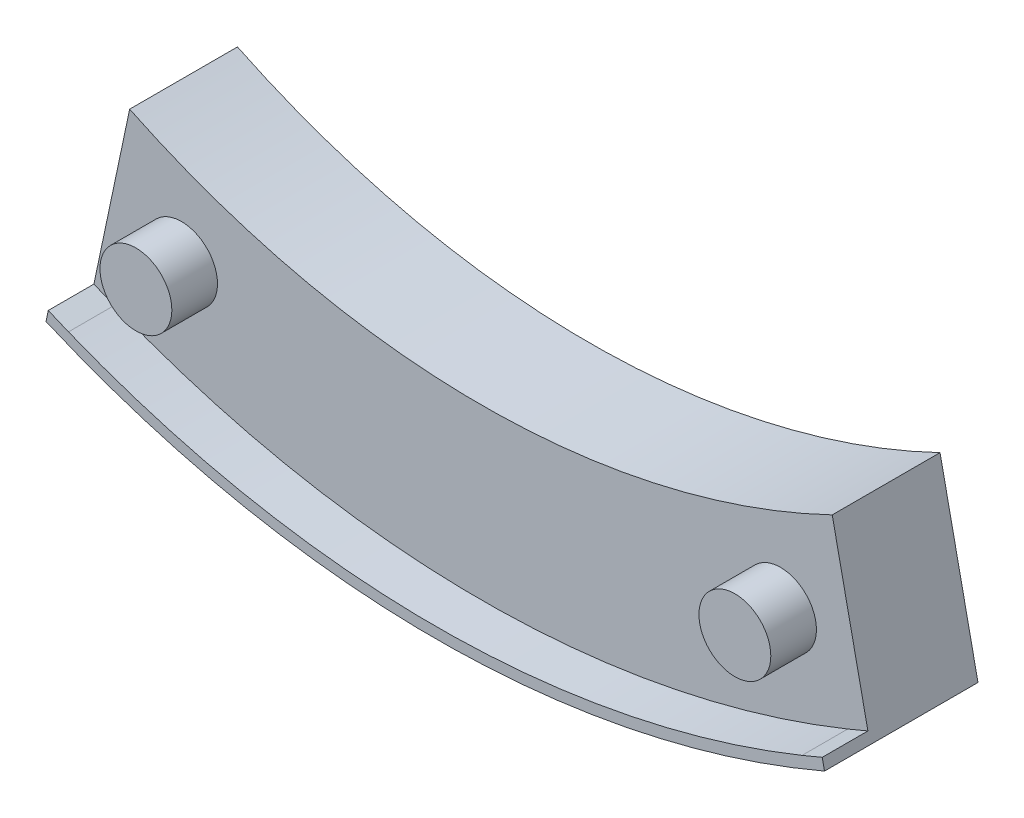
ISO-10303-21;
HEADER;
FILE_DESCRIPTION(('STEP AP214'),'2;1');
FILE_NAME('part.step','',(''),(''),'','','');
FILE_SCHEMA(('AUTOMOTIVE_DESIGN { 1 0 10303 214 1 1 1 1 }'));
ENDSEC;
DATA;
#1=APPLICATION_CONTEXT('core data for automotive mechanical design processes');
#2=APPLICATION_PROTOCOL_DEFINITION('international standard','automotive_design',2000,#1);
#3=PRODUCT_CONTEXT('',#1,'mechanical');
#4=PRODUCT('Part','Part','',(#3));
#5=PRODUCT_RELATED_PRODUCT_CATEGORY('part','',(#4));
#6=PRODUCT_DEFINITION_FORMATION('','',#4);
#7=PRODUCT_DEFINITION_CONTEXT('part definition',#1,'design');
#8=PRODUCT_DEFINITION('design','',#6,#7);
#9=PRODUCT_DEFINITION_SHAPE('','',#8);
#10=(LENGTH_UNIT() NAMED_UNIT(*) SI_UNIT(.MILLI.,.METRE.));
#11=(NAMED_UNIT(*) PLANE_ANGLE_UNIT() SI_UNIT($,.RADIAN.));
#12=(NAMED_UNIT(*) SI_UNIT($,.STERADIAN.) SOLID_ANGLE_UNIT());
#13=UNCERTAINTY_MEASURE_WITH_UNIT(LENGTH_MEASURE(1.E-05),#10,'distance_accuracy_value','');
#14=(GEOMETRIC_REPRESENTATION_CONTEXT(3) GLOBAL_UNCERTAINTY_ASSIGNED_CONTEXT((#13)) GLOBAL_UNIT_ASSIGNED_CONTEXT((#10,
#11,#12)) REPRESENTATION_CONTEXT('',''));
#15=CARTESIAN_POINT('',(0.,0.,0.));
#16=DIRECTION('',(0.,0.,1.));
#17=DIRECTION('',(1.,0.,0.));
#18=AXIS2_PLACEMENT_3D('',#15,#16,#17);
#19=CARTESIAN_POINT('',(10.5320699095967,2.21997126669057,6.));
#20=DIRECTION('',(0.97849931061418,0.206250088794103,0.));
#21=DIRECTION('',(-0.206250088794103,0.97849931061418,0.));
#22=AXIS2_PLACEMENT_3D('',#19,#20,#21);
#23=PLANE('',#22);
#24=DIRECTION('',(0.206250088794103,-0.97849931061418,0.));
#25=VECTOR('',#24,1.);
#26=CARTESIAN_POINT('',(10.5320699095967,2.21997126669057,0.));
#27=LINE('',#26,#25);
#28=CARTESIAN_POINT('',(19.5439178504137,-40.534371526598,0.));
#29=VERTEX_POINT('',#28);
#30=CARTESIAN_POINT('',(21.6564801158046,-50.5568676738755,0.));
#31=VERTEX_POINT('',#30);
#32=EDGE_CURVE('E149',#29,#31,#27,.T.);
#33=ORIENTED_EDGE('',*,*,#32,.F.);
#34=DIRECTION('',(0.,0.,-1.));
#35=VECTOR('',#34,1.);
#36=CARTESIAN_POINT('',(19.5439178504137,-40.534371526598,6.));
#37=LINE('',#36,#35);
#38=CARTESIAN_POINT('',(19.5439178504137,-40.534371526598,6.));
#39=VERTEX_POINT('',#38);
#40=EDGE_CURVE('E11',#39,#29,#37,.T.);
#41=ORIENTED_EDGE('',*,*,#40,.F.);
#42=DIRECTION('',(0.206250088794103,-0.97849931061418,0.));
#43=VECTOR('',#42,1.);
#44=CARTESIAN_POINT('',(10.5320699095967,2.21997126669057,6.));
#45=LINE('',#44,#43);
#46=CARTESIAN_POINT('',(21.5296214587928,-49.9550201345254,6.));
#47=VERTEX_POINT('',#46);
#48=EDGE_CURVE('E154',#39,#47,#45,.T.);
#49=ORIENTED_EDGE('',*,*,#48,.T.);
#50=DIRECTION('',(0.,0.,-1.));
#51=VECTOR('',#50,1.);
#52=CARTESIAN_POINT('',(21.5296214587928,-49.9550201345254,8.54));
#53=LINE('',#52,#51);
#54=CARTESIAN_POINT('',(21.5296214587928,-49.9550201345254,8.54));
#55=VERTEX_POINT('',#54);
#56=EDGE_CURVE('E135',#55,#47,#53,.T.);
#57=ORIENTED_EDGE('',*,*,#56,.F.);
#58=DIRECTION('',(0.206250088794103,-0.97849931061418,0.));
#59=VECTOR('',#58,1.);
#60=CARTESIAN_POINT('',(10.5320699095967,2.21997126669057,8.54));
#61=LINE('',#60,#59);
#62=CARTESIAN_POINT('',(21.6564801158046,-50.5568676738755,8.54));
#63=VERTEX_POINT('',#62);
#64=EDGE_CURVE('E127',#55,#63,#61,.T.);
#65=ORIENTED_EDGE('',*,*,#64,.T.);
#66=DIRECTION('',(0.,0.,-1.));
#67=VECTOR('',#66,1.);
#68=CARTESIAN_POINT('',(21.6564801158046,-50.5568676738755,8.54));
#69=LINE('',#68,#67);
#70=EDGE_CURVE('E137',#63,#31,#69,.T.);
#71=ORIENTED_EDGE('',*,*,#70,.T.);
#72=EDGE_LOOP('',(#33,#41,#49,#57,#65,#71));
#73=FACE_BOUND('',#72,.T.);
#74=ADVANCED_FACE('F35',(#73),#23,.T.);
#75=CARTESIAN_POINT('',(0.,0.,6.));
#76=DIRECTION('',(0.,0.,-1.));
#77=DIRECTION('',(-1.,0.,0.));
#78=AXIS2_PLACEMENT_3D('',#75,#76,#77);
#79=CYLINDRICAL_SURFACE('',#78,45.);
#80=CARTESIAN_POINT('',(0.,0.,0.));
#81=DIRECTION('',(0.,0.,1.));
#82=DIRECTION('',(1.,0.,0.));
#83=AXIS2_PLACEMENT_3D('',#80,#81,#82);
#84=CIRCLE('',#83,45.);
#85=CARTESIAN_POINT('',(-19.5539721232094,-40.5295222548299,0.));
#86=VERTEX_POINT('',#85);
#87=EDGE_CURVE('E171',#86,#29,#84,.T.);
#88=ORIENTED_EDGE('',*,*,#87,.F.);
#89=DIRECTION('',(0.,0.,-1.));
#90=VECTOR('',#89,1.);
#91=CARTESIAN_POINT('',(-19.5539721232094,-40.5295222548299,6.));
#92=LINE('',#91,#90);
#93=CARTESIAN_POINT('',(-19.5539721232094,-40.5295222548299,6.));
#94=VERTEX_POINT('',#93);
#95=EDGE_CURVE('E43',#94,#86,#92,.T.);
#96=ORIENTED_EDGE('',*,*,#95,.F.);
#97=CARTESIAN_POINT('',(0.,0.,6.));
#98=DIRECTION('',(0.,0.,1.));
#99=DIRECTION('',(1.,0.,0.));
#100=AXIS2_PLACEMENT_3D('',#97,#98,#99);
#101=CIRCLE('',#100,45.);
#102=EDGE_CURVE('E157',#94,#39,#101,.T.);
#103=ORIENTED_EDGE('',*,*,#102,.T.);
#104=ORIENTED_EDGE('',*,*,#40,.T.);
#105=EDGE_LOOP('',(#88,#96,#103,#104));
#106=FACE_BOUND('',#105,.T.);
#107=ADVANCED_FACE('F182',(#106),#79,.F.);
#108=CARTESIAN_POINT('',(-10.5309074990491,2.22260426887287,6.));
#109=DIRECTION('',(0.978445311290457,-0.206506108417455,0.));
#110=DIRECTION('',(0.206506108417455,0.978445311290457,0.));
#111=AXIS2_PLACEMENT_3D('',#108,#109,#110);
#112=PLANE('',#111);
#113=DIRECTION('',(-0.206506108417455,-0.978445311290457,0.));
#114=VECTOR('',#113,1.);
#115=CARTESIAN_POINT('',(-10.5309074990491,2.22260426887287,0.));
#116=LINE('',#115,#114);
#117=CARTESIAN_POINT('',(-21.6691509882845,-50.5514381145277,0.));
#118=VERTEX_POINT('',#117);
#119=EDGE_CURVE('E152',#86,#118,#116,.T.);
#120=ORIENTED_EDGE('',*,*,#119,.T.);
#121=DIRECTION('',(0.,0.,-1.));
#122=VECTOR('',#121,1.);
#123=CARTESIAN_POINT('',(-21.6691509882845,-50.5514381145277,8.54));
#124=LINE('',#123,#122);
#125=CARTESIAN_POINT('',(-21.6691509882845,-50.5514381145277,8.54));
#126=VERTEX_POINT('',#125);
#127=EDGE_CURVE('E140',#126,#118,#124,.T.);
#128=ORIENTED_EDGE('',*,*,#127,.F.);
#129=DIRECTION('',(-0.206506108417455,-0.978445311290457,0.));
#130=VECTOR('',#129,1.);
#131=CARTESIAN_POINT('',(-10.5309074990491,2.22260426887287,8.54));
#132=LINE('',#131,#130);
#133=CARTESIAN_POINT('',(-21.5432489913471,-49.954902643836,8.54));
#134=VERTEX_POINT('',#133);
#135=EDGE_CURVE('E121',#134,#126,#132,.T.);
#136=ORIENTED_EDGE('',*,*,#135,.F.);
#137=DIRECTION('',(0.,0.,-1.));
#138=VECTOR('',#137,1.);
#139=CARTESIAN_POINT('',(-21.5432489913471,-49.954902643836,8.54));
#140=LINE('',#139,#138);
#141=CARTESIAN_POINT('',(-21.5432489913471,-49.954902643836,6.));
#142=VERTEX_POINT('',#141);
#143=EDGE_CURVE('E106',#134,#142,#140,.T.);
#144=ORIENTED_EDGE('',*,*,#143,.T.);
#145=DIRECTION('',(-0.206506108417455,-0.978445311290457,0.));
#146=VECTOR('',#145,1.);
#147=CARTESIAN_POINT('',(-10.5309074990491,2.22260426887287,6.));
#148=LINE('',#147,#146);
#149=EDGE_CURVE('E159',#94,#142,#148,.T.);
#150=ORIENTED_EDGE('',*,*,#149,.F.);
#151=ORIENTED_EDGE('',*,*,#95,.T.);
#152=EDGE_LOOP('',(#120,#128,#136,#144,#150,#151));
#153=FACE_BOUND('',#152,.T.);
#154=ADVANCED_FACE('F176',(#153),#112,.F.);
#155=CARTESIAN_POINT('',(0.,0.,6.));
#156=DIRECTION('',(0.,0.,1.));
#157=DIRECTION('',(1.,0.,0.));
#158=AXIS2_PLACEMENT_3D('',#155,#156,#157);
#159=PLANE('',#158);
#160=CARTESIAN_POINT('',(-0.00666864370315337,-0.00143147623325041,6.));
#161=DIRECTION('',(0.,0.,1.));
#162=DIRECTION('',(1.,0.,0.));
#163=AXIS2_PLACEMENT_3D('',#160,#161,#162);
#164=CIRCLE('',#163,54.3982762664986);
#165=CARTESIAN_POINT('',(20.4045944277233,-50.4251639897564,6.));
#166=VERTEX_POINT('',#165);
#167=CARTESIAN_POINT('',(-20.4182219602776,-50.425046499067,6.));
#168=VERTEX_POINT('',#167);
#169=EDGE_CURVE('E64',#166,#168,#164,.F.);
#170=ORIENTED_EDGE('',*,*,#169,.F.);
#171=DIRECTION('',(-0.922673845099727,-0.385581347537566,0.));
#172=VECTOR('',#171,1.);
#173=CARTESIAN_POINT('',(20.9731618127836,-50.1875621766544,6.));
#174=LINE('',#173,#172);
#175=EDGE_CURVE('E151',#47,#166,#174,.T.);
#176=ORIENTED_EDGE('',*,*,#175,.F.);
#177=ORIENTED_EDGE('',*,*,#48,.F.);
#178=ORIENTED_EDGE('',*,*,#102,.F.);
#179=ORIENTED_EDGE('',*,*,#149,.T.);
#180=DIRECTION('',(0.922673845099728,-0.385581347537564,0.));
#181=VECTOR('',#180,1.);
#182=CARTESIAN_POINT('',(-20.975146059426,-50.192310364011,6.));
#183=LINE('',#182,#181);
#184=EDGE_CURVE('E162',#142,#168,#183,.T.);
#185=ORIENTED_EDGE('',*,*,#184,.T.);
#186=EDGE_LOOP('',(#170,#176,#177,#178,#179,#185));
#187=FACE_BOUND('',#186,.T.);
#188=CARTESIAN_POINT('',(-16.6659753937199,-46.5019888826997,6.));
#189=DIRECTION('',(0.,0.,1.));
#190=DIRECTION('',(1.,0.,0.));
#191=AXIS2_PLACEMENT_3D('',#188,#189,#190);
#192=CIRCLE('',#191,1.99999994336487);
#193=CARTESIAN_POINT('',(-14.665975450355,-46.5019888826997,6.));
#194=VERTEX_POINT('',#193);
#195=EDGE_CURVE('E164',#194,#194,#192,.T.);
#196=ORIENTED_EDGE('',*,*,#195,.F.);
#197=EDGE_LOOP('',(#196));
#198=FACE_BOUND('',#197,.T.);
#199=CARTESIAN_POINT('',(16.6659753937201,-46.5019888826996,6.));
#200=DIRECTION('',(0.,0.,1.));
#201=DIRECTION('',(1.,0.,0.));
#202=AXIS2_PLACEMENT_3D('',#199,#200,#201);
#203=CIRCLE('',#202,1.99999994336488);
#204=CARTESIAN_POINT('',(18.665975337085,-46.5019888826996,6.));
#205=VERTEX_POINT('',#204);
#206=EDGE_CURVE('E167',#205,#205,#203,.T.);
#207=ORIENTED_EDGE('',*,*,#206,.F.);
#208=EDGE_LOOP('',(#207));
#209=FACE_BOUND('',#208,.T.);
#210=ADVANCED_FACE('F188',(#187,#198,#209),#159,.T.);
#211=CARTESIAN_POINT('',(0.,0.,0.));
#212=DIRECTION('',(0.,0.,1.));
#213=DIRECTION('',(1.,0.,0.));
#214=AXIS2_PLACEMENT_3D('',#211,#212,#213);
#215=PLANE('',#214);
#216=CARTESIAN_POINT('',(0.,0.,0.));
#217=DIRECTION('',(0.,0.,1.));
#218=DIRECTION('',(1.,0.,0.));
#219=AXIS2_PLACEMENT_3D('',#216,#217,#218);
#220=CIRCLE('',#219,55.);
#221=EDGE_CURVE('E116',#118,#31,#220,.T.);
#222=ORIENTED_EDGE('',*,*,#221,.F.);
#223=ORIENTED_EDGE('',*,*,#119,.F.);
#224=ORIENTED_EDGE('',*,*,#87,.T.);
#225=ORIENTED_EDGE('',*,*,#32,.T.);
#226=EDGE_LOOP('',(#222,#223,#224,#225));
#227=FACE_BOUND('',#226,.T.);
#228=ADVANCED_FACE('F181',(#227),#215,.F.);
#229=CARTESIAN_POINT('',(-16.6659753937199,-46.5019888826997,8.54));
#230=DIRECTION('',(0.,0.,-1.));
#231=DIRECTION('',(-1.,0.,0.));
#232=AXIS2_PLACEMENT_3D('',#229,#230,#231);
#233=CYLINDRICAL_SURFACE('',#232,1.99999994336487);
#234=ORIENTED_EDGE('',*,*,#195,.T.);
#235=EDGE_LOOP('',(#234));
#236=FACE_BOUND('',#235,.T.);
#237=CARTESIAN_POINT('',(-16.6659753937199,-46.5019888826997,8.54));
#238=DIRECTION('',(0.,0.,1.));
#239=DIRECTION('',(1.,0.,0.));
#240=AXIS2_PLACEMENT_3D('',#237,#238,#239);
#241=CIRCLE('',#240,1.99999994336487);
#242=CARTESIAN_POINT('',(-14.665975450355,-46.5019888826997,8.54));
#243=VERTEX_POINT('',#242);
#244=EDGE_CURVE('E146',#243,#243,#241,.T.);
#245=ORIENTED_EDGE('',*,*,#244,.F.);
#246=EDGE_LOOP('',(#245));
#247=FACE_BOUND('',#246,.T.);
#248=ADVANCED_FACE('F194',(#236,#247),#233,.T.);
#249=CARTESIAN_POINT('',(0.,0.,8.54));
#250=DIRECTION('',(0.,0.,1.));
#251=DIRECTION('',(1.,0.,0.));
#252=AXIS2_PLACEMENT_3D('',#249,#250,#251);
#253=PLANE('',#252);
#254=ORIENTED_EDGE('',*,*,#244,.T.);
#255=EDGE_LOOP('',(#254));
#256=FACE_BOUND('',#255,.T.);
#257=ADVANCED_FACE('F200',(#256),#253,.T.);
#258=CARTESIAN_POINT('',(16.6659753937201,-46.5019888826996,8.54));
#259=DIRECTION('',(0.,0.,-1.));
#260=DIRECTION('',(-1.,0.,0.));
#261=AXIS2_PLACEMENT_3D('',#258,#259,#260);
#262=CYLINDRICAL_SURFACE('',#261,1.99999994336488);
#263=ORIENTED_EDGE('',*,*,#206,.T.);
#264=EDGE_LOOP('',(#263));
#265=FACE_BOUND('',#264,.T.);
#266=CARTESIAN_POINT('',(16.6659753937201,-46.5019888826996,8.54));
#267=DIRECTION('',(0.,0.,1.));
#268=DIRECTION('',(1.,0.,0.));
#269=AXIS2_PLACEMENT_3D('',#266,#267,#268);
#270=CIRCLE('',#269,1.99999994336488);
#271=CARTESIAN_POINT('',(18.665975337085,-46.5019888826996,8.54));
#272=VERTEX_POINT('',#271);
#273=EDGE_CURVE('E105',#272,#272,#270,.T.);
#274=ORIENTED_EDGE('',*,*,#273,.F.);
#275=EDGE_LOOP('',(#274));
#276=FACE_BOUND('',#275,.T.);
#277=ADVANCED_FACE('F204',(#265,#276),#262,.T.);
#278=CARTESIAN_POINT('',(0.,0.,8.54));
#279=DIRECTION('',(0.,0.,1.));
#280=DIRECTION('',(1.,0.,0.));
#281=AXIS2_PLACEMENT_3D('',#278,#279,#280);
#282=PLANE('',#281);
#283=ORIENTED_EDGE('',*,*,#273,.T.);
#284=EDGE_LOOP('',(#283));
#285=FACE_BOUND('',#284,.T.);
#286=ADVANCED_FACE('F208',(#285),#282,.T.);
#287=CARTESIAN_POINT('',(-0.00666864370315337,-0.00143147623325041,8.54));
#288=DIRECTION('',(0.,0.,-1.));
#289=DIRECTION('',(-1.,0.,0.));
#290=AXIS2_PLACEMENT_3D('',#287,#288,#289);
#291=CYLINDRICAL_SURFACE('',#290,54.3982762664986);
#292=DIRECTION('',(0.,0.,-1.));
#293=VECTOR('',#292,1.);
#294=CARTESIAN_POINT('',(20.4045944277233,-50.4251639897564,8.54));
#295=LINE('',#294,#293);
#296=CARTESIAN_POINT('',(20.4045944277233,-50.4251639897564,8.54));
#297=VERTEX_POINT('',#296);
#298=EDGE_CURVE('E131',#297,#166,#295,.T.);
#299=ORIENTED_EDGE('',*,*,#298,.T.);
#300=ORIENTED_EDGE('',*,*,#169,.T.);
#301=DIRECTION('',(0.,0.,-1.));
#302=VECTOR('',#301,1.);
#303=CARTESIAN_POINT('',(-20.4182219602776,-50.425046499067,8.54));
#304=LINE('',#303,#302);
#305=CARTESIAN_POINT('',(-20.4182219602776,-50.425046499067,8.54));
#306=VERTEX_POINT('',#305);
#307=EDGE_CURVE('E98',#306,#168,#304,.T.);
#308=ORIENTED_EDGE('',*,*,#307,.F.);
#309=CARTESIAN_POINT('',(-0.00666864370315337,-0.00143147623325041,8.54));
#310=DIRECTION('',(0.,0.,1.));
#311=DIRECTION('',(1.,0.,0.));
#312=AXIS2_PLACEMENT_3D('',#309,#310,#311);
#313=CIRCLE('',#312,54.3982762664986);
#314=EDGE_CURVE('E101',#306,#297,#313,.T.);
#315=ORIENTED_EDGE('',*,*,#314,.T.);
#316=EDGE_LOOP('',(#299,#300,#308,#315));
#317=FACE_BOUND('',#316,.T.);
#318=ADVANCED_FACE('F100',(#317),#291,.F.);
#319=CARTESIAN_POINT('',(-20.975146059426,-50.192310364011,8.54));
#320=DIRECTION('',(0.385581347537564,0.922673845099728,0.));
#321=DIRECTION('',(-0.922673845099728,0.385581347537564,0.));
#322=AXIS2_PLACEMENT_3D('',#319,#320,#321);
#323=PLANE('',#322);
#324=ORIENTED_EDGE('',*,*,#307,.T.);
#325=ORIENTED_EDGE('',*,*,#184,.F.);
#326=ORIENTED_EDGE('',*,*,#143,.F.);
#327=DIRECTION('',(0.922673845099728,-0.385581347537564,0.));
#328=VECTOR('',#327,1.);
#329=CARTESIAN_POINT('',(-20.975146059426,-50.192310364011,8.54));
#330=LINE('',#329,#328);
#331=EDGE_CURVE('E111',#134,#306,#330,.T.);
#332=ORIENTED_EDGE('',*,*,#331,.T.);
#333=EDGE_LOOP('',(#324,#325,#326,#332));
#334=FACE_BOUND('',#333,.T.);
#335=ADVANCED_FACE('F118',(#334),#323,.T.);
#336=CARTESIAN_POINT('',(0.,0.,8.54));
#337=DIRECTION('',(0.,0.,-1.));
#338=DIRECTION('',(-1.,0.,0.));
#339=AXIS2_PLACEMENT_3D('',#336,#337,#338);
#340=CYLINDRICAL_SURFACE('',#339,55.);
#341=ORIENTED_EDGE('',*,*,#221,.T.);
#342=ORIENTED_EDGE('',*,*,#70,.F.);
#343=CARTESIAN_POINT('',(0.,0.,8.54));
#344=DIRECTION('',(0.,0.,1.));
#345=DIRECTION('',(1.,0.,0.));
#346=AXIS2_PLACEMENT_3D('',#343,#344,#345);
#347=CIRCLE('',#346,55.);
#348=EDGE_CURVE('E123',#126,#63,#347,.T.);
#349=ORIENTED_EDGE('',*,*,#348,.F.);
#350=ORIENTED_EDGE('',*,*,#127,.T.);
#351=EDGE_LOOP('',(#341,#342,#349,#350));
#352=FACE_BOUND('',#351,.T.);
#353=ADVANCED_FACE('F217',(#352),#340,.T.);
#354=CARTESIAN_POINT('',(20.9731618127836,-50.1875621766544,8.54));
#355=DIRECTION('',(0.385581347537566,-0.922673845099727,0.));
#356=DIRECTION('',(0.922673845099727,0.385581347537566,0.));
#357=AXIS2_PLACEMENT_3D('',#354,#355,#356);
#358=PLANE('',#357);
#359=ORIENTED_EDGE('',*,*,#175,.T.);
#360=ORIENTED_EDGE('',*,*,#298,.F.);
#361=DIRECTION('',(-0.922673845099727,-0.385581347537566,0.));
#362=VECTOR('',#361,1.);
#363=CARTESIAN_POINT('',(20.9731618127836,-50.1875621766544,8.54));
#364=LINE('',#363,#362);
#365=EDGE_CURVE('E114',#55,#297,#364,.T.);
#366=ORIENTED_EDGE('',*,*,#365,.F.);
#367=ORIENTED_EDGE('',*,*,#56,.T.);
#368=EDGE_LOOP('',(#359,#360,#366,#367));
#369=FACE_BOUND('',#368,.T.);
#370=ADVANCED_FACE('F220',(#369),#358,.F.);
#371=CARTESIAN_POINT('',(0.,0.,8.54));
#372=DIRECTION('',(0.,0.,1.));
#373=DIRECTION('',(1.,0.,0.));
#374=AXIS2_PLACEMENT_3D('',#371,#372,#373);
#375=PLANE('',#374);
#376=ORIENTED_EDGE('',*,*,#314,.F.);
#377=ORIENTED_EDGE('',*,*,#331,.F.);
#378=ORIENTED_EDGE('',*,*,#135,.T.);
#379=ORIENTED_EDGE('',*,*,#348,.T.);
#380=ORIENTED_EDGE('',*,*,#64,.F.);
#381=ORIENTED_EDGE('',*,*,#365,.T.);
#382=EDGE_LOOP('',(#376,#377,#378,#379,#380,#381));
#383=FACE_BOUND('',#382,.T.);
#384=ADVANCED_FACE('F110',(#383),#375,.T.);
#385=CLOSED_SHELL('',(#74,#107,#154,#210,#228,#248,#257,#277,#286,#318,#335,#353,#370,#384));
#386=MANIFOLD_SOLID_BREP('B2',#385);
#387=ADVANCED_BREP_SHAPE_REPRESENTATION('',(#18,#386),#14);
#388=SHAPE_DEFINITION_REPRESENTATION(#9,#387);
ENDSEC;
END-ISO-10303-21;
